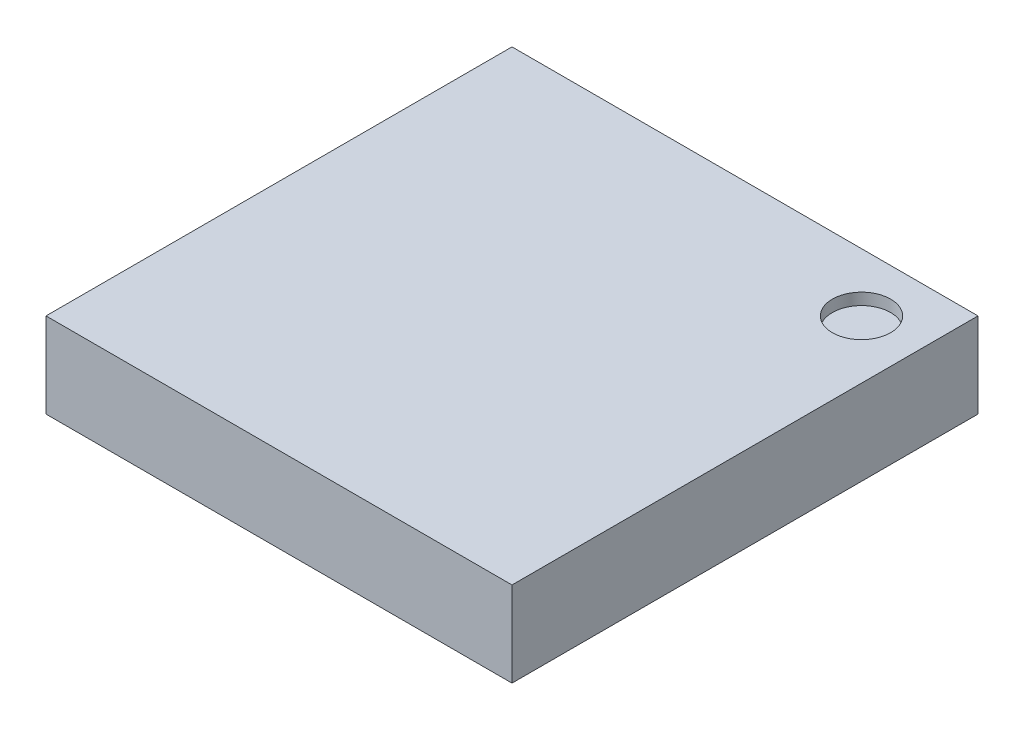
ISO-10303-21;
HEADER;
FILE_DESCRIPTION(('STEP AP214'),'2;1');
FILE_NAME('part.step','',(''),(''),'','','');
FILE_SCHEMA(('AUTOMOTIVE_DESIGN { 1 0 10303 214 1 1 1 1 }'));
ENDSEC;
DATA;
#1=APPLICATION_CONTEXT('core data for automotive mechanical design processes');
#2=APPLICATION_PROTOCOL_DEFINITION('international standard','automotive_design',2000,#1);
#3=PRODUCT_CONTEXT('',#1,'mechanical');
#4=PRODUCT('Part','Part','',(#3));
#5=PRODUCT_RELATED_PRODUCT_CATEGORY('part','',(#4));
#6=PRODUCT_DEFINITION_FORMATION('','',#4);
#7=PRODUCT_DEFINITION_CONTEXT('part definition',#1,'design');
#8=PRODUCT_DEFINITION('design','',#6,#7);
#9=PRODUCT_DEFINITION_SHAPE('','',#8);
#10=(LENGTH_UNIT() NAMED_UNIT(*) SI_UNIT(.MILLI.,.METRE.));
#11=(NAMED_UNIT(*) PLANE_ANGLE_UNIT() SI_UNIT($,.RADIAN.));
#12=(NAMED_UNIT(*) SI_UNIT($,.STERADIAN.) SOLID_ANGLE_UNIT());
#13=UNCERTAINTY_MEASURE_WITH_UNIT(LENGTH_MEASURE(1.E-05),#10,'distance_accuracy_value','');
#14=(GEOMETRIC_REPRESENTATION_CONTEXT(3) GLOBAL_UNCERTAINTY_ASSIGNED_CONTEXT((#13)) GLOBAL_UNIT_ASSIGNED_CONTEXT((#10,
#11,#12)) REPRESENTATION_CONTEXT('',''));
#15=CARTESIAN_POINT('',(0.,0.,0.));
#16=DIRECTION('',(0.,0.,1.));
#17=DIRECTION('',(1.,0.,0.));
#18=AXIS2_PLACEMENT_3D('',#15,#16,#17);
#19=CARTESIAN_POINT('',(2.,0.73,2.));
#20=DIRECTION('',(-1.,0.,0.));
#21=DIRECTION('',(0.,0.,1.));
#22=AXIS2_PLACEMENT_3D('',#19,#20,#21);
#23=PLANE('',#22);
#24=DIRECTION('',(0.,0.,-1.));
#25=VECTOR('',#24,1.);
#26=CARTESIAN_POINT('',(2.,0.,2.));
#27=LINE('',#26,#25);
#28=CARTESIAN_POINT('',(2.,0.,2.));
#29=VERTEX_POINT('',#28);
#30=CARTESIAN_POINT('',(2.,0.,-2.));
#31=VERTEX_POINT('',#30);
#32=EDGE_CURVE('E109',#29,#31,#27,.T.);
#33=ORIENTED_EDGE('',*,*,#32,.T.);
#34=DIRECTION('',(0.,-1.,0.));
#35=VECTOR('',#34,1.);
#36=CARTESIAN_POINT('',(2.,0.73,-2.));
#37=LINE('',#36,#35);
#38=CARTESIAN_POINT('',(2.,0.73,-2.));
#39=VERTEX_POINT('',#38);
#40=EDGE_CURVE('E11',#39,#31,#37,.T.);
#41=ORIENTED_EDGE('',*,*,#40,.F.);
#42=DIRECTION('',(0.,0.,-1.));
#43=VECTOR('',#42,1.);
#44=CARTESIAN_POINT('',(2.,0.73,2.));
#45=LINE('',#44,#43);
#46=CARTESIAN_POINT('',(2.,0.73,2.));
#47=VERTEX_POINT('',#46);
#48=EDGE_CURVE('E93',#47,#39,#45,.T.);
#49=ORIENTED_EDGE('',*,*,#48,.F.);
#50=DIRECTION('',(0.,-1.,0.));
#51=VECTOR('',#50,1.);
#52=CARTESIAN_POINT('',(2.,0.73,2.));
#53=LINE('',#52,#51);
#54=EDGE_CURVE('E105',#47,#29,#53,.T.);
#55=ORIENTED_EDGE('',*,*,#54,.T.);
#56=EDGE_LOOP('',(#33,#41,#49,#55));
#57=FACE_BOUND('',#56,.T.);
#58=ADVANCED_FACE('F41',(#57),#23,.F.);
#59=CARTESIAN_POINT('',(-2.,0.73,-2.));
#60=DIRECTION('',(0.,0.,1.));
#61=DIRECTION('',(1.,0.,0.));
#62=AXIS2_PLACEMENT_3D('',#59,#60,#61);
#63=PLANE('',#62);
#64=DIRECTION('',(-1.,0.,0.));
#65=VECTOR('',#64,1.);
#66=CARTESIAN_POINT('',(-2.,0.,-2.));
#67=LINE('',#66,#65);
#68=CARTESIAN_POINT('',(-2.,0.,-2.));
#69=VERTEX_POINT('',#68);
#70=EDGE_CURVE('E98',#31,#69,#67,.T.);
#71=ORIENTED_EDGE('',*,*,#70,.T.);
#72=DIRECTION('',(0.,-1.,0.));
#73=VECTOR('',#72,1.);
#74=CARTESIAN_POINT('',(-2.,0.73,-2.));
#75=LINE('',#74,#73);
#76=CARTESIAN_POINT('',(-2.,0.73,-2.));
#77=VERTEX_POINT('',#76);
#78=EDGE_CURVE('E50',#77,#69,#75,.T.);
#79=ORIENTED_EDGE('',*,*,#78,.F.);
#80=DIRECTION('',(-1.,0.,0.));
#81=VECTOR('',#80,1.);
#82=CARTESIAN_POINT('',(-2.,0.73,-2.));
#83=LINE('',#82,#81);
#84=EDGE_CURVE('E88',#39,#77,#83,.T.);
#85=ORIENTED_EDGE('',*,*,#84,.F.);
#86=ORIENTED_EDGE('',*,*,#40,.T.);
#87=EDGE_LOOP('',(#71,#79,#85,#86));
#88=FACE_BOUND('',#87,.T.);
#89=ADVANCED_FACE('F97',(#88),#63,.F.);
#90=CARTESIAN_POINT('',(-2.,0.73,2.));
#91=DIRECTION('',(1.,0.,0.));
#92=DIRECTION('',(0.,0.,-1.));
#93=AXIS2_PLACEMENT_3D('',#90,#91,#92);
#94=PLANE('',#93);
#95=DIRECTION('',(0.,0.,1.));
#96=VECTOR('',#95,1.);
#97=CARTESIAN_POINT('',(-2.,0.,2.));
#98=LINE('',#97,#96);
#99=CARTESIAN_POINT('',(-2.,0.,2.));
#100=VERTEX_POINT('',#99);
#101=EDGE_CURVE('E75',#69,#100,#98,.T.);
#102=ORIENTED_EDGE('',*,*,#101,.T.);
#103=DIRECTION('',(0.,-1.,0.));
#104=VECTOR('',#103,1.);
#105=CARTESIAN_POINT('',(-2.,0.73,2.));
#106=LINE('',#105,#104);
#107=CARTESIAN_POINT('',(-2.,0.73,2.));
#108=VERTEX_POINT('',#107);
#109=EDGE_CURVE('E100',#108,#100,#106,.T.);
#110=ORIENTED_EDGE('',*,*,#109,.F.);
#111=DIRECTION('',(0.,0.,1.));
#112=VECTOR('',#111,1.);
#113=CARTESIAN_POINT('',(-2.,0.73,2.));
#114=LINE('',#113,#112);
#115=EDGE_CURVE('E91',#77,#108,#114,.T.);
#116=ORIENTED_EDGE('',*,*,#115,.F.);
#117=ORIENTED_EDGE('',*,*,#78,.T.);
#118=EDGE_LOOP('',(#102,#110,#116,#117));
#119=FACE_BOUND('',#118,.T.);
#120=ADVANCED_FACE('F101',(#119),#94,.F.);
#121=CARTESIAN_POINT('',(-2.,0.73,2.));
#122=DIRECTION('',(0.,0.,-1.));
#123=DIRECTION('',(-1.,0.,0.));
#124=AXIS2_PLACEMENT_3D('',#121,#122,#123);
#125=PLANE('',#124);
#126=DIRECTION('',(1.,0.,0.));
#127=VECTOR('',#126,1.);
#128=CARTESIAN_POINT('',(-2.,0.,2.));
#129=LINE('',#128,#127);
#130=EDGE_CURVE('E81',#100,#29,#129,.T.);
#131=ORIENTED_EDGE('',*,*,#130,.T.);
#132=ORIENTED_EDGE('',*,*,#54,.F.);
#133=DIRECTION('',(1.,0.,0.));
#134=VECTOR('',#133,1.);
#135=CARTESIAN_POINT('',(-2.,0.73,2.));
#136=LINE('',#135,#134);
#137=EDGE_CURVE('E58',#108,#47,#136,.T.);
#138=ORIENTED_EDGE('',*,*,#137,.F.);
#139=ORIENTED_EDGE('',*,*,#109,.T.);
#140=EDGE_LOOP('',(#131,#132,#138,#139));
#141=FACE_BOUND('',#140,.T.);
#142=ADVANCED_FACE('F123',(#141),#125,.F.);
#143=CARTESIAN_POINT('',(0.,0.73,0.));
#144=DIRECTION('',(0.,-1.,0.));
#145=DIRECTION('',(0.,0.,-1.));
#146=AXIS2_PLACEMENT_3D('',#143,#144,#145);
#147=PLANE('',#146);
#148=CARTESIAN_POINT('',(1.5,0.73,-1.5));
#149=DIRECTION('',(0.,1.,0.));
#150=DIRECTION('',(0.,0.,1.));
#151=AXIS2_PLACEMENT_3D('',#148,#149,#150);
#152=CIRCLE('',#151,0.25);
#153=CARTESIAN_POINT('',(1.5,0.73,-1.25));
#154=VERTEX_POINT('',#153);
#155=EDGE_CURVE('E130',#154,#154,#152,.T.);
#156=ORIENTED_EDGE('',*,*,#155,.F.);
#157=EDGE_LOOP('',(#156));
#158=FACE_BOUND('',#157,.T.);
#159=ORIENTED_EDGE('',*,*,#48,.T.);
#160=ORIENTED_EDGE('',*,*,#84,.T.);
#161=ORIENTED_EDGE('',*,*,#115,.T.);
#162=ORIENTED_EDGE('',*,*,#137,.T.);
#163=EDGE_LOOP('',(#159,#160,#161,#162));
#164=FACE_BOUND('',#163,.T.);
#165=ADVANCED_FACE('F89',(#158,#164),#147,.F.);
#166=CARTESIAN_POINT('',(0.,0.,0.));
#167=DIRECTION('',(0.,-1.,0.));
#168=DIRECTION('',(0.,0.,-1.));
#169=AXIS2_PLACEMENT_3D('',#166,#167,#168);
#170=PLANE('',#169);
#171=ORIENTED_EDGE('',*,*,#32,.F.);
#172=ORIENTED_EDGE('',*,*,#130,.F.);
#173=ORIENTED_EDGE('',*,*,#101,.F.);
#174=ORIENTED_EDGE('',*,*,#70,.F.);
#175=EDGE_LOOP('',(#171,#172,#173,#174));
#176=FACE_BOUND('',#175,.T.);
#177=ADVANCED_FACE('F126',(#176),#170,.T.);
#178=CARTESIAN_POINT('',(1.5,0.63,-1.5));
#179=DIRECTION('',(0.,1.,0.));
#180=DIRECTION('',(0.,0.,1.));
#181=AXIS2_PLACEMENT_3D('',#178,#179,#180);
#182=CYLINDRICAL_SURFACE('',#181,0.25);
#183=CARTESIAN_POINT('',(1.5,0.63,-1.5));
#184=DIRECTION('',(0.,1.,0.));
#185=DIRECTION('',(0.,0.,1.));
#186=AXIS2_PLACEMENT_3D('',#183,#184,#185);
#187=CIRCLE('',#186,0.25);
#188=CARTESIAN_POINT('',(1.5,0.63,-1.25));
#189=VERTEX_POINT('',#188);
#190=EDGE_CURVE('E113',#189,#189,#187,.T.);
#191=ORIENTED_EDGE('',*,*,#190,.F.);
#192=EDGE_LOOP('',(#191));
#193=FACE_BOUND('',#192,.T.);
#194=ORIENTED_EDGE('',*,*,#155,.T.);
#195=EDGE_LOOP('',(#194));
#196=FACE_BOUND('',#195,.T.);
#197=ADVANCED_FACE('F140',(#193,#196),#182,.F.);
#198=CARTESIAN_POINT('',(1.5,0.63,-1.5));
#199=DIRECTION('',(0.,1.,0.));
#200=DIRECTION('',(0.,0.,1.));
#201=AXIS2_PLACEMENT_3D('',#198,#199,#200);
#202=PLANE('',#201);
#203=ORIENTED_EDGE('',*,*,#190,.T.);
#204=EDGE_LOOP('',(#203));
#205=FACE_BOUND('',#204,.T.);
#206=ADVANCED_FACE('F138',(#205),#202,.T.);
#207=CLOSED_SHELL('',(#58,#89,#120,#142,#165,#177,#197,#206));
#208=MANIFOLD_SOLID_BREP('B2',#207);
#209=ADVANCED_BREP_SHAPE_REPRESENTATION('',(#18,#208),#14);
#210=SHAPE_DEFINITION_REPRESENTATION(#9,#209);
ENDSEC;
END-ISO-10303-21;
